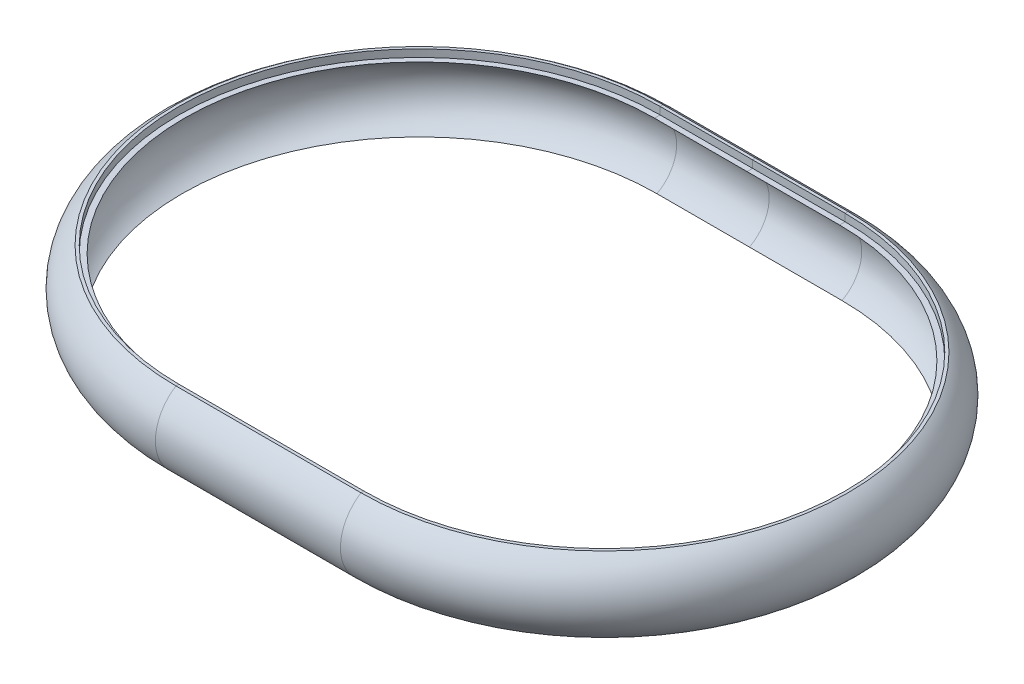
ISO-10303-21;
HEADER;
FILE_DESCRIPTION(('STEP AP214'),'2;1');
FILE_NAME('part.step','',(''),(''),'','','');
FILE_SCHEMA(('AUTOMOTIVE_DESIGN { 1 0 10303 214 1 1 1 1 }'));
ENDSEC;
DATA;
#1=APPLICATION_CONTEXT('core data for automotive mechanical design processes');
#2=APPLICATION_PROTOCOL_DEFINITION('international standard','automotive_design',2000,#1);
#3=PRODUCT_CONTEXT('',#1,'mechanical');
#4=PRODUCT('Part','Part','',(#3));
#5=PRODUCT_RELATED_PRODUCT_CATEGORY('part','',(#4));
#6=PRODUCT_DEFINITION_FORMATION('','',#4);
#7=PRODUCT_DEFINITION_CONTEXT('part definition',#1,'design');
#8=PRODUCT_DEFINITION('design','',#6,#7);
#9=PRODUCT_DEFINITION_SHAPE('','',#8);
#10=(LENGTH_UNIT() NAMED_UNIT(*) SI_UNIT(.MILLI.,.METRE.));
#11=(NAMED_UNIT(*) PLANE_ANGLE_UNIT() SI_UNIT($,.RADIAN.));
#12=(NAMED_UNIT(*) SI_UNIT($,.STERADIAN.) SOLID_ANGLE_UNIT());
#13=UNCERTAINTY_MEASURE_WITH_UNIT(LENGTH_MEASURE(1.E-05),#10,'distance_accuracy_value','');
#14=(GEOMETRIC_REPRESENTATION_CONTEXT(3) GLOBAL_UNCERTAINTY_ASSIGNED_CONTEXT((#13)) GLOBAL_UNIT_ASSIGNED_CONTEXT((#10,
#11,#12)) REPRESENTATION_CONTEXT('',''));
#15=CARTESIAN_POINT('',(0.,0.,0.));
#16=DIRECTION('',(0.,0.,1.));
#17=DIRECTION('',(1.,0.,0.));
#18=AXIS2_PLACEMENT_3D('',#15,#16,#17);
#19=CARTESIAN_POINT('',(25.,8.0398038031899,-130.));
#20=DIRECTION('',(0.,0.,-1.));
#21=DIRECTION('',(-1.,0.,0.));
#22=AXIS2_PLACEMENT_3D('',#19,#20,#21);
#23=PLANE('',#22);
#24=DIRECTION('',(0.,-1.,0.));
#25=VECTOR('',#24,1.);
#26=CARTESIAN_POINT('',(25.,8.0398038031899,-130.));
#27=LINE('',#26,#25);
#28=CARTESIAN_POINT('',(25.,8.0398038031899,-130.));
#29=VERTEX_POINT('',#28);
#30=CARTESIAN_POINT('',(25.,6.0398038031899,-130.));
#31=VERTEX_POINT('',#30);
#32=EDGE_CURVE('E222',#29,#31,#27,.T.);
#33=ORIENTED_EDGE('',*,*,#32,.F.);
#34=DIRECTION('',(-1.,0.,0.));
#35=VECTOR('',#34,1.);
#36=CARTESIAN_POINT('',(25.,8.0398038031899,-130.));
#37=LINE('',#36,#35);
#38=CARTESIAN_POINT('',(0.,8.0398038031899,-130.));
#39=VERTEX_POINT('',#38);
#40=EDGE_CURVE('E221',#29,#39,#37,.T.);
#41=ORIENTED_EDGE('',*,*,#40,.T.);
#42=DIRECTION('',(0.,-1.,0.));
#43=VECTOR('',#42,1.);
#44=CARTESIAN_POINT('',(0.,8.0398038031899,-130.));
#45=LINE('',#44,#43);
#46=CARTESIAN_POINT('',(0.,6.0398038031899,-130.));
#47=VERTEX_POINT('',#46);
#48=EDGE_CURVE('E198',#39,#47,#45,.T.);
#49=ORIENTED_EDGE('',*,*,#48,.T.);
#50=DIRECTION('',(-1.,0.,0.));
#51=VECTOR('',#50,1.);
#52=CARTESIAN_POINT('',(25.,6.0398038031899,-130.));
#53=LINE('',#52,#51);
#54=EDGE_CURVE('E227',#31,#47,#53,.T.);
#55=ORIENTED_EDGE('',*,*,#54,.F.);
#56=EDGE_LOOP('',(#33,#41,#49,#55));
#57=FACE_BOUND('',#56,.T.);
#58=ADVANCED_FACE('F39',(#57),#23,.F.);
#59=CARTESIAN_POINT('',(0.,8.0398038031899,-130.));
#60=DIRECTION('',(0.,0.,-1.));
#61=DIRECTION('',(-1.,0.,0.));
#62=AXIS2_PLACEMENT_3D('',#59,#60,#61);
#63=PLANE('',#62);
#64=DIRECTION('',(-1.,0.,0.));
#65=VECTOR('',#64,1.);
#66=CARTESIAN_POINT('',(0.,6.0398038031899,-130.));
#67=LINE('',#66,#65);
#68=CARTESIAN_POINT('',(-25.,6.0398038031899,-130.));
#69=VERTEX_POINT('',#68);
#70=EDGE_CURVE('E177',#47,#69,#67,.T.);
#71=ORIENTED_EDGE('',*,*,#70,.F.);
#72=ORIENTED_EDGE('',*,*,#48,.F.);
#73=DIRECTION('',(-1.,0.,0.));
#74=VECTOR('',#73,1.);
#75=CARTESIAN_POINT('',(0.,8.0398038031899,-130.));
#76=LINE('',#75,#74);
#77=CARTESIAN_POINT('',(-25.,8.0398038031899,-130.));
#78=VERTEX_POINT('',#77);
#79=EDGE_CURVE('E203',#39,#78,#76,.T.);
#80=ORIENTED_EDGE('',*,*,#79,.T.);
#81=DIRECTION('',(0.,-1.,0.));
#82=VECTOR('',#81,1.);
#83=CARTESIAN_POINT('',(-25.,8.0398038031899,-130.));
#84=LINE('',#83,#82);
#85=EDGE_CURVE('E218',#78,#69,#84,.T.);
#86=ORIENTED_EDGE('',*,*,#85,.T.);
#87=EDGE_LOOP('',(#71,#72,#80,#86));
#88=FACE_BOUND('',#87,.T.);
#89=ADVANCED_FACE('F202',(#88),#63,.F.);
#90=CARTESIAN_POINT('',(0.,6.0398038031899,-130.));
#91=DIRECTION('',(0.,-1.,0.));
#92=DIRECTION('',(0.,0.,-1.));
#93=AXIS2_PLACEMENT_3D('',#90,#91,#92);
#94=PLANE('',#93);
#95=DIRECTION('',(-1.,0.,0.));
#96=VECTOR('',#95,1.);
#97=CARTESIAN_POINT('',(0.,6.0398038031899,-128.5));
#98=LINE('',#97,#96);
#99=CARTESIAN_POINT('',(0.,6.0398038031899,-128.5));
#100=VERTEX_POINT('',#99);
#101=CARTESIAN_POINT('',(-25.,6.0398038031899,-128.5));
#102=VERTEX_POINT('',#101);
#103=EDGE_CURVE('E170',#100,#102,#98,.T.);
#104=ORIENTED_EDGE('',*,*,#103,.F.);
#105=DIRECTION('',(0.,0.,1.));
#106=VECTOR('',#105,1.);
#107=CARTESIAN_POINT('',(0.,6.0398038031899,-130.));
#108=LINE('',#107,#106);
#109=EDGE_CURVE('E206',#47,#100,#108,.T.);
#110=ORIENTED_EDGE('',*,*,#109,.F.);
#111=ORIENTED_EDGE('',*,*,#70,.T.);
#112=DIRECTION('',(0.,0.,1.));
#113=VECTOR('',#112,1.);
#114=CARTESIAN_POINT('',(-25.,6.0398038031899,-130.));
#115=LINE('',#114,#113);
#116=EDGE_CURVE('E336',#69,#102,#115,.T.);
#117=ORIENTED_EDGE('',*,*,#116,.T.);
#118=EDGE_LOOP('',(#104,#110,#111,#117));
#119=FACE_BOUND('',#118,.T.);
#120=ADVANCED_FACE('F452',(#119),#94,.F.);
#121=CARTESIAN_POINT('',(0.,-3.11708337553693,-124.481117419472));
#122=DIRECTION('',(-1.,0.,0.));
#123=DIRECTION('',(0.,0.,1.));
#124=AXIS2_PLACEMENT_3D('',#121,#122,#123);
#125=CYLINDRICAL_SURFACE('',#124,10.);
#126=DIRECTION('',(-1.,0.,0.));
#127=VECTOR('',#126,1.);
#128=CARTESIAN_POINT('',(0.,-11.9601961968101,-129.150095426514));
#129=LINE('',#128,#127);
#130=CARTESIAN_POINT('',(0.,-11.9601961968101,-129.150095426514));
#131=VERTEX_POINT('',#130);
#132=CARTESIAN_POINT('',(-25.,-11.9601961968101,-129.150095426514));
#133=VERTEX_POINT('',#132);
#134=EDGE_CURVE('E163',#131,#133,#129,.T.);
#135=ORIENTED_EDGE('',*,*,#134,.F.);
#136=CARTESIAN_POINT('',(0.,-3.11708337553693,-124.481117419472));
#137=DIRECTION('',(-1.,0.,0.));
#138=DIRECTION('',(0.,0.,1.));
#139=AXIS2_PLACEMENT_3D('',#136,#137,#138);
#140=CIRCLE('',#139,10.);
#141=EDGE_CURVE('E325',#100,#131,#140,.T.);
#142=ORIENTED_EDGE('',*,*,#141,.F.);
#143=ORIENTED_EDGE('',*,*,#103,.T.);
#144=CARTESIAN_POINT('',(-25.,-3.11708337553693,-124.481117419472));
#145=DIRECTION('',(-1.,0.,0.));
#146=DIRECTION('',(0.,0.,1.));
#147=AXIS2_PLACEMENT_3D('',#144,#145,#146);
#148=CIRCLE('',#147,10.);
#149=EDGE_CURVE('E331',#102,#133,#148,.T.);
#150=ORIENTED_EDGE('',*,*,#149,.T.);
#151=EDGE_LOOP('',(#135,#142,#143,#150));
#152=FACE_BOUND('',#151,.T.);
#153=ADVANCED_FACE('F434',(#152),#125,.F.);
#154=CARTESIAN_POINT('',(0.,-11.9601961968101,-129.150095426514));
#155=DIRECTION('',(0.,1.,0.));
#156=DIRECTION('',(0.,0.,1.));
#157=AXIS2_PLACEMENT_3D('',#154,#155,#156);
#158=PLANE('',#157);
#159=DIRECTION('',(-1.,0.,0.));
#160=VECTOR('',#159,1.);
#161=CARTESIAN_POINT('',(0.,-11.9601961968101,-131.150095426514));
#162=LINE('',#161,#160);
#163=CARTESIAN_POINT('',(0.,-11.9601961968101,-131.150095426514));
#164=VERTEX_POINT('',#163);
#165=CARTESIAN_POINT('',(-25.,-11.9601961968101,-131.150095426514));
#166=VERTEX_POINT('',#165);
#167=EDGE_CURVE('E282',#164,#166,#162,.T.);
#168=ORIENTED_EDGE('',*,*,#167,.F.);
#169=DIRECTION('',(0.,0.,-1.));
#170=VECTOR('',#169,1.);
#171=CARTESIAN_POINT('',(0.,-11.9601961968101,-129.150095426514));
#172=LINE('',#171,#170);
#173=EDGE_CURVE('E235',#131,#164,#172,.T.);
#174=ORIENTED_EDGE('',*,*,#173,.F.);
#175=ORIENTED_EDGE('',*,*,#134,.T.);
#176=DIRECTION('',(0.,0.,-1.));
#177=VECTOR('',#176,1.);
#178=CARTESIAN_POINT('',(-25.,-11.9601961968101,-129.150095426514));
#179=LINE('',#178,#177);
#180=EDGE_CURVE('E326',#133,#166,#179,.T.);
#181=ORIENTED_EDGE('',*,*,#180,.T.);
#182=EDGE_LOOP('',(#168,#174,#175,#181));
#183=FACE_BOUND('',#182,.T.);
#184=ADVANCED_FACE('F435',(#183),#158,.F.);
#185=CARTESIAN_POINT('',(0.,-2.07625149666633,-124.345123922936));
#186=DIRECTION('',(-1.,0.,0.));
#187=DIRECTION('',(0.,0.,1.));
#188=AXIS2_PLACEMENT_3D('',#185,#186,#187);
#189=CYLINDRICAL_SURFACE('',#188,12.);
#190=DIRECTION('',(-1.,0.,0.));
#191=VECTOR('',#190,1.);
#192=CARTESIAN_POINT('',(0.,8.0398038031899,-130.8));
#193=LINE('',#192,#191);
#194=CARTESIAN_POINT('',(0.,8.0398038031899,-130.8));
#195=VERTEX_POINT('',#194);
#196=CARTESIAN_POINT('',(-25.,8.0398038031899,-130.8));
#197=VERTEX_POINT('',#196);
#198=EDGE_CURVE('E242',#195,#197,#193,.T.);
#199=ORIENTED_EDGE('',*,*,#198,.F.);
#200=CARTESIAN_POINT('',(0.,-2.07625149666633,-124.345123922936));
#201=DIRECTION('',(1.,0.,0.));
#202=DIRECTION('',(0.,0.,1.));
#203=AXIS2_PLACEMENT_3D('',#200,#201,#202);
#204=CIRCLE('',#203,12.);
#205=EDGE_CURVE('E231',#164,#195,#204,.T.);
#206=ORIENTED_EDGE('',*,*,#205,.F.);
#207=ORIENTED_EDGE('',*,*,#167,.T.);
#208=CARTESIAN_POINT('',(-25.,-2.07625149666633,-124.345123922936));
#209=DIRECTION('',(1.,0.,0.));
#210=DIRECTION('',(0.,0.,1.));
#211=AXIS2_PLACEMENT_3D('',#208,#209,#210);
#212=CIRCLE('',#211,12.);
#213=EDGE_CURVE('E283',#166,#197,#212,.T.);
#214=ORIENTED_EDGE('',*,*,#213,.T.);
#215=EDGE_LOOP('',(#199,#206,#207,#214));
#216=FACE_BOUND('',#215,.T.);
#217=ADVANCED_FACE('F280',(#216),#189,.T.);
#218=CARTESIAN_POINT('',(0.,8.0398038031899,-130.8));
#219=DIRECTION('',(0.,-1.,0.));
#220=DIRECTION('',(0.,0.,-1.));
#221=AXIS2_PLACEMENT_3D('',#218,#219,#220);
#222=PLANE('',#221);
#223=DIRECTION('',(0.,0.,1.));
#224=VECTOR('',#223,1.);
#225=CARTESIAN_POINT('',(-25.,8.0398038031899,-130.8));
#226=LINE('',#225,#224);
#227=EDGE_CURVE('E215',#197,#78,#226,.T.);
#228=ORIENTED_EDGE('',*,*,#227,.T.);
#229=ORIENTED_EDGE('',*,*,#79,.F.);
#230=DIRECTION('',(0.,0.,1.));
#231=VECTOR('',#230,1.);
#232=CARTESIAN_POINT('',(0.,8.0398038031899,-130.8));
#233=LINE('',#232,#231);
#234=EDGE_CURVE('E213',#195,#39,#233,.T.);
#235=ORIENTED_EDGE('',*,*,#234,.F.);
#236=ORIENTED_EDGE('',*,*,#198,.T.);
#237=EDGE_LOOP('',(#228,#229,#235,#236));
#238=FACE_BOUND('',#237,.T.);
#239=ADVANCED_FACE('F211',(#238),#222,.F.);
#240=CARTESIAN_POINT('',(-25.,6.0398038031899,-65.));
#241=DIRECTION('',(0.,1.,0.));
#242=DIRECTION('',(0.,0.,1.));
#243=AXIS2_PLACEMENT_3D('',#240,#241,#242);
#244=CYLINDRICAL_SURFACE('',#243,65.);
#245=CARTESIAN_POINT('',(-25.,6.0398038031899,-65.));
#246=DIRECTION('',(0.,1.,0.));
#247=DIRECTION('',(0.,0.,-1.));
#248=AXIS2_PLACEMENT_3D('',#245,#246,#247);
#249=CIRCLE('',#248,65.);
#250=CARTESIAN_POINT('',(-25.,6.0398038031899,0.));
#251=VERTEX_POINT('',#250);
#252=EDGE_CURVE('E349',#69,#251,#249,.T.);
#253=ORIENTED_EDGE('',*,*,#252,.F.);
#254=ORIENTED_EDGE('',*,*,#85,.F.);
#255=CARTESIAN_POINT('',(-25.,8.0398038031899,-65.));
#256=DIRECTION('',(0.,1.,0.));
#257=DIRECTION('',(0.,0.,-1.));
#258=AXIS2_PLACEMENT_3D('',#255,#256,#257);
#259=CIRCLE('',#258,65.);
#260=CARTESIAN_POINT('',(-25.,8.0398038031899,0.));
#261=VERTEX_POINT('',#260);
#262=EDGE_CURVE('E241',#78,#261,#259,.T.);
#263=ORIENTED_EDGE('',*,*,#262,.T.);
#264=DIRECTION('',(0.,-1.,0.));
#265=VECTOR('',#264,1.);
#266=CARTESIAN_POINT('',(-25.,8.0398038031899,0.));
#267=LINE('',#266,#265);
#268=EDGE_CURVE('E345',#261,#251,#267,.T.);
#269=ORIENTED_EDGE('',*,*,#268,.T.);
#270=EDGE_LOOP('',(#253,#254,#263,#269));
#271=FACE_BOUND('',#270,.T.);
#272=ADVANCED_FACE('F464',(#271),#244,.F.);
#273=CARTESIAN_POINT('',(-25.,6.0398038031899,-130.));
#274=DIRECTION('',(0.,-1.,0.));
#275=DIRECTION('',(0.,0.,-1.));
#276=AXIS2_PLACEMENT_3D('',#273,#274,#275);
#277=PLANE('',#276);
#278=CARTESIAN_POINT('',(-25.,6.0398038031899,-65.));
#279=DIRECTION('',(0.,1.,0.));
#280=DIRECTION('',(0.,0.,-1.));
#281=AXIS2_PLACEMENT_3D('',#278,#279,#280);
#282=CIRCLE('',#281,63.5);
#283=CARTESIAN_POINT('',(-25.,6.0398038031899,-1.5));
#284=VERTEX_POINT('',#283);
#285=EDGE_CURVE('E147',#102,#284,#282,.T.);
#286=ORIENTED_EDGE('',*,*,#285,.F.);
#287=ORIENTED_EDGE('',*,*,#116,.F.);
#288=ORIENTED_EDGE('',*,*,#252,.T.);
#289=DIRECTION('',(0.,0.,-1.));
#290=VECTOR('',#289,1.);
#291=CARTESIAN_POINT('',(-25.,6.0398038031899,0.));
#292=LINE('',#291,#290);
#293=EDGE_CURVE('E352',#251,#284,#292,.T.);
#294=ORIENTED_EDGE('',*,*,#293,.T.);
#295=EDGE_LOOP('',(#286,#287,#288,#294));
#296=FACE_BOUND('',#295,.T.);
#297=ADVANCED_FACE('F460',(#296),#277,.F.);
#298=CARTESIAN_POINT('',(-25.,-3.11708337553693,-65.));
#299=DIRECTION('',(0.,1.,0.));
#300=DIRECTION('',(0.,0.,1.));
#301=AXIS2_PLACEMENT_3D('',#298,#299,#300);
#302=TOROIDAL_SURFACE('',#301,59.4811174194724,10.);
#303=CARTESIAN_POINT('',(-25.,-11.9601961968101,-65.));
#304=DIRECTION('',(0.,1.,0.));
#305=DIRECTION('',(0.,0.,-1.));
#306=AXIS2_PLACEMENT_3D('',#303,#304,#305);
#307=CIRCLE('',#306,64.1500954265135);
#308=CARTESIAN_POINT('',(-25.,-11.9601961968101,-0.849904573486465));
#309=VERTEX_POINT('',#308);
#310=EDGE_CURVE('E139',#133,#309,#307,.T.);
#311=ORIENTED_EDGE('',*,*,#310,.F.);
#312=ORIENTED_EDGE('',*,*,#149,.F.);
#313=ORIENTED_EDGE('',*,*,#285,.T.);
#314=CARTESIAN_POINT('',(-25.,-3.11708337553693,-5.51888258052763));
#315=DIRECTION('',(1.,0.,0.));
#316=DIRECTION('',(0.,0.,-1.));
#317=AXIS2_PLACEMENT_3D('',#314,#315,#316);
#318=CIRCLE('',#317,10.);
#319=EDGE_CURVE('E381',#284,#309,#318,.T.);
#320=ORIENTED_EDGE('',*,*,#319,.T.);
#321=EDGE_LOOP('',(#311,#312,#313,#320));
#322=FACE_BOUND('',#321,.T.);
#323=ADVANCED_FACE('F463',(#322),#302,.F.);
#324=CARTESIAN_POINT('',(-25.,-11.9601961968101,-129.150095426514));
#325=DIRECTION('',(0.,1.,0.));
#326=DIRECTION('',(0.,0.,1.));
#327=AXIS2_PLACEMENT_3D('',#324,#325,#326);
#328=PLANE('',#327);
#329=CARTESIAN_POINT('',(-25.,-11.9601961968101,-65.));
#330=DIRECTION('',(0.,1.,0.));
#331=DIRECTION('',(0.,0.,-1.));
#332=AXIS2_PLACEMENT_3D('',#329,#330,#331);
#333=CIRCLE('',#332,66.1500954265135);
#334=CARTESIAN_POINT('',(-25.,-11.9601961968101,1.15009542651354));
#335=VERTEX_POINT('',#334);
#336=EDGE_CURVE('E132',#166,#335,#333,.T.);
#337=ORIENTED_EDGE('',*,*,#336,.F.);
#338=ORIENTED_EDGE('',*,*,#180,.F.);
#339=ORIENTED_EDGE('',*,*,#310,.T.);
#340=DIRECTION('',(0.,0.,1.));
#341=VECTOR('',#340,1.);
#342=CARTESIAN_POINT('',(-25.,-11.9601961968101,-0.849904573486465));
#343=LINE('',#342,#341);
#344=EDGE_CURVE('E293',#309,#335,#343,.T.);
#345=ORIENTED_EDGE('',*,*,#344,.T.);
#346=EDGE_LOOP('',(#337,#338,#339,#345));
#347=FACE_BOUND('',#346,.T.);
#348=ADVANCED_FACE('F477',(#347),#328,.F.);
#349=CARTESIAN_POINT('',(-25.,-2.07625149666633,-65.));
#350=DIRECTION('',(0.,1.,0.));
#351=DIRECTION('',(0.,0.,1.));
#352=AXIS2_PLACEMENT_3D('',#349,#350,#351);
#353=TOROIDAL_SURFACE('',#352,59.3451239229362,12.);
#354=CARTESIAN_POINT('',(-25.,8.0398038031899,-65.));
#355=DIRECTION('',(0.,1.,0.));
#356=DIRECTION('',(0.,0.,-1.));
#357=AXIS2_PLACEMENT_3D('',#354,#355,#356);
#358=CIRCLE('',#357,65.8);
#359=CARTESIAN_POINT('',(-25.,8.0398038031899,0.799999999999995));
#360=VERTEX_POINT('',#359);
#361=EDGE_CURVE('E247',#197,#360,#358,.T.);
#362=ORIENTED_EDGE('',*,*,#361,.F.);
#363=ORIENTED_EDGE('',*,*,#213,.F.);
#364=ORIENTED_EDGE('',*,*,#336,.T.);
#365=CARTESIAN_POINT('',(-25.,-2.07625149666633,-5.65487607706382));
#366=DIRECTION('',(-1.,0.,0.));
#367=DIRECTION('',(0.,0.,-1.));
#368=AXIS2_PLACEMENT_3D('',#365,#366,#367);
#369=CIRCLE('',#368,12.);
#370=EDGE_CURVE('E289',#335,#360,#369,.T.);
#371=ORIENTED_EDGE('',*,*,#370,.T.);
#372=EDGE_LOOP('',(#362,#363,#364,#371));
#373=FACE_BOUND('',#372,.T.);
#374=ADVANCED_FACE('F487',(#373),#353,.T.);
#375=CARTESIAN_POINT('',(-25.,8.0398038031899,-130.8));
#376=DIRECTION('',(0.,-1.,0.));
#377=DIRECTION('',(0.,0.,-1.));
#378=AXIS2_PLACEMENT_3D('',#375,#376,#377);
#379=PLANE('',#378);
#380=DIRECTION('',(0.,0.,-1.));
#381=VECTOR('',#380,1.);
#382=CARTESIAN_POINT('',(-25.,8.0398038031899,0.799999999999995));
#383=LINE('',#382,#381);
#384=EDGE_CURVE('E243',#360,#261,#383,.T.);
#385=ORIENTED_EDGE('',*,*,#384,.T.);
#386=ORIENTED_EDGE('',*,*,#262,.F.);
#387=ORIENTED_EDGE('',*,*,#227,.F.);
#388=ORIENTED_EDGE('',*,*,#361,.T.);
#389=EDGE_LOOP('',(#385,#386,#387,#388));
#390=FACE_BOUND('',#389,.T.);
#391=ADVANCED_FACE('F504',(#390),#379,.F.);
#392=CARTESIAN_POINT('',(-25.,8.0398038031899,0.));
#393=DIRECTION('',(0.,0.,1.));
#394=DIRECTION('',(1.,0.,0.));
#395=AXIS2_PLACEMENT_3D('',#392,#393,#394);
#396=PLANE('',#395);
#397=DIRECTION('',(1.,0.,0.));
#398=VECTOR('',#397,1.);
#399=CARTESIAN_POINT('',(-25.,6.0398038031899,0.));
#400=LINE('',#399,#398);
#401=CARTESIAN_POINT('',(25.,6.0398038031899,0.));
#402=VERTEX_POINT('',#401);
#403=EDGE_CURVE('E359',#251,#402,#400,.T.);
#404=ORIENTED_EDGE('',*,*,#403,.F.);
#405=ORIENTED_EDGE('',*,*,#268,.F.);
#406=DIRECTION('',(1.,0.,0.));
#407=VECTOR('',#406,1.);
#408=CARTESIAN_POINT('',(-25.,8.0398038031899,0.));
#409=LINE('',#408,#407);
#410=CARTESIAN_POINT('',(25.,8.0398038031899,0.));
#411=VERTEX_POINT('',#410);
#412=EDGE_CURVE('E246',#261,#411,#409,.T.);
#413=ORIENTED_EDGE('',*,*,#412,.T.);
#414=DIRECTION('',(0.,-1.,0.));
#415=VECTOR('',#414,1.);
#416=CARTESIAN_POINT('',(25.,8.0398038031899,0.));
#417=LINE('',#416,#415);
#418=EDGE_CURVE('E267',#411,#402,#417,.T.);
#419=ORIENTED_EDGE('',*,*,#418,.T.);
#420=EDGE_LOOP('',(#404,#405,#413,#419));
#421=FACE_BOUND('',#420,.T.);
#422=ADVANCED_FACE('F468',(#421),#396,.F.);
#423=CARTESIAN_POINT('',(-25.,6.0398038031899,0.));
#424=DIRECTION('',(0.,-1.,0.));
#425=DIRECTION('',(0.,0.,-1.));
#426=AXIS2_PLACEMENT_3D('',#423,#424,#425);
#427=PLANE('',#426);
#428=DIRECTION('',(1.,0.,0.));
#429=VECTOR('',#428,1.);
#430=CARTESIAN_POINT('',(-25.,6.0398038031899,-1.5));
#431=LINE('',#430,#429);
#432=CARTESIAN_POINT('',(25.,6.0398038031899,-1.5));
#433=VERTEX_POINT('',#432);
#434=EDGE_CURVE('E362',#284,#433,#431,.T.);
#435=ORIENTED_EDGE('',*,*,#434,.F.);
#436=ORIENTED_EDGE('',*,*,#293,.F.);
#437=ORIENTED_EDGE('',*,*,#403,.T.);
#438=DIRECTION('',(0.,0.,-1.));
#439=VECTOR('',#438,1.);
#440=CARTESIAN_POINT('',(25.,6.0398038031899,0.));
#441=LINE('',#440,#439);
#442=EDGE_CURVE('E358',#402,#433,#441,.T.);
#443=ORIENTED_EDGE('',*,*,#442,.T.);
#444=EDGE_LOOP('',(#435,#436,#437,#443));
#445=FACE_BOUND('',#444,.T.);
#446=ADVANCED_FACE('F423',(#445),#427,.F.);
#447=CARTESIAN_POINT('',(-25.,-3.11708337553693,-5.51888258052763));
#448=DIRECTION('',(1.,0.,0.));
#449=DIRECTION('',(0.,0.,-1.));
#450=AXIS2_PLACEMENT_3D('',#447,#448,#449);
#451=CYLINDRICAL_SURFACE('',#450,10.);
#452=DIRECTION('',(1.,0.,0.));
#453=VECTOR('',#452,1.);
#454=CARTESIAN_POINT('',(-25.,-11.9601961968101,-0.849904573486465));
#455=LINE('',#454,#453);
#456=CARTESIAN_POINT('',(25.,-11.9601961968101,-0.849904573486465));
#457=VERTEX_POINT('',#456);
#458=EDGE_CURVE('E113',#309,#457,#455,.T.);
#459=ORIENTED_EDGE('',*,*,#458,.F.);
#460=ORIENTED_EDGE('',*,*,#319,.F.);
#461=ORIENTED_EDGE('',*,*,#434,.T.);
#462=CARTESIAN_POINT('',(25.,-3.11708337553693,-5.51888258052763));
#463=DIRECTION('',(1.,0.,0.));
#464=DIRECTION('',(0.,0.,-1.));
#465=AXIS2_PLACEMENT_3D('',#462,#463,#464);
#466=CIRCLE('',#465,10.);
#467=EDGE_CURVE('E260',#433,#457,#466,.T.);
#468=ORIENTED_EDGE('',*,*,#467,.T.);
#469=EDGE_LOOP('',(#459,#460,#461,#468));
#470=FACE_BOUND('',#469,.T.);
#471=ADVANCED_FACE('F417',(#470),#451,.F.);
#472=CARTESIAN_POINT('',(-25.,-11.9601961968101,-0.849904573486465));
#473=DIRECTION('',(0.,1.,0.));
#474=DIRECTION('',(0.,0.,1.));
#475=AXIS2_PLACEMENT_3D('',#472,#473,#474);
#476=PLANE('',#475);
#477=DIRECTION('',(1.,0.,0.));
#478=VECTOR('',#477,1.);
#479=CARTESIAN_POINT('',(-25.,-11.9601961968101,1.15009542651354));
#480=LINE('',#479,#478);
#481=CARTESIAN_POINT('',(25.,-11.9601961968101,1.15009542651354));
#482=VERTEX_POINT('',#481);
#483=EDGE_CURVE('E105',#335,#482,#480,.T.);
#484=ORIENTED_EDGE('',*,*,#483,.F.);
#485=ORIENTED_EDGE('',*,*,#344,.F.);
#486=ORIENTED_EDGE('',*,*,#458,.T.);
#487=DIRECTION('',(0.,0.,1.));
#488=VECTOR('',#487,1.);
#489=CARTESIAN_POINT('',(25.,-11.9601961968101,-0.849904573486465));
#490=LINE('',#489,#488);
#491=EDGE_CURVE('E257',#457,#482,#490,.T.);
#492=ORIENTED_EDGE('',*,*,#491,.T.);
#493=EDGE_LOOP('',(#484,#485,#486,#492));
#494=FACE_BOUND('',#493,.T.);
#495=ADVANCED_FACE('F480',(#494),#476,.F.);
#496=CARTESIAN_POINT('',(-25.,-2.07625149666633,-5.65487607706382));
#497=DIRECTION('',(1.,0.,0.));
#498=DIRECTION('',(0.,0.,-1.));
#499=AXIS2_PLACEMENT_3D('',#496,#497,#498);
#500=CYLINDRICAL_SURFACE('',#499,12.);
#501=DIRECTION('',(1.,0.,0.));
#502=VECTOR('',#501,1.);
#503=CARTESIAN_POINT('',(-25.,8.0398038031899,0.799999999999995));
#504=LINE('',#503,#502);
#505=CARTESIAN_POINT('',(25.,8.0398038031899,0.799999999999995));
#506=VERTEX_POINT('',#505);
#507=EDGE_CURVE('E95',#360,#506,#504,.T.);
#508=ORIENTED_EDGE('',*,*,#507,.F.);
#509=ORIENTED_EDGE('',*,*,#370,.F.);
#510=ORIENTED_EDGE('',*,*,#483,.T.);
#511=CARTESIAN_POINT('',(25.,-2.07625149666633,-5.65487607706382));
#512=DIRECTION('',(-1.,0.,0.));
#513=DIRECTION('',(0.,0.,-1.));
#514=AXIS2_PLACEMENT_3D('',#511,#512,#513);
#515=CIRCLE('',#514,12.);
#516=EDGE_CURVE('E251',#482,#506,#515,.T.);
#517=ORIENTED_EDGE('',*,*,#516,.T.);
#518=EDGE_LOOP('',(#508,#509,#510,#517));
#519=FACE_BOUND('',#518,.T.);
#520=ADVANCED_FACE('F489',(#519),#500,.T.);
#521=CARTESIAN_POINT('',(-25.,8.0398038031899,0.799999999999995));
#522=DIRECTION('',(0.,-1.,0.));
#523=DIRECTION('',(0.,0.,-1.));
#524=AXIS2_PLACEMENT_3D('',#521,#522,#523);
#525=PLANE('',#524);
#526=DIRECTION('',(0.,0.,-1.));
#527=VECTOR('',#526,1.);
#528=CARTESIAN_POINT('',(25.,8.0398038031899,0.799999999999995));
#529=LINE('',#528,#527);
#530=EDGE_CURVE('E248',#506,#411,#529,.T.);
#531=ORIENTED_EDGE('',*,*,#530,.T.);
#532=ORIENTED_EDGE('',*,*,#412,.F.);
#533=ORIENTED_EDGE('',*,*,#384,.F.);
#534=ORIENTED_EDGE('',*,*,#507,.T.);
#535=EDGE_LOOP('',(#531,#532,#533,#534));
#536=FACE_BOUND('',#535,.T.);
#537=ADVANCED_FACE('F508',(#536),#525,.F.);
#538=CARTESIAN_POINT('',(25.,6.0398038031899,-65.));
#539=DIRECTION('',(0.,1.,0.));
#540=DIRECTION('',(0.,0.,1.));
#541=AXIS2_PLACEMENT_3D('',#538,#539,#540);
#542=CYLINDRICAL_SURFACE('',#541,65.);
#543=CARTESIAN_POINT('',(25.,6.0398038031899,-65.));
#544=DIRECTION('',(0.,1.,0.));
#545=DIRECTION('',(0.,0.,1.));
#546=AXIS2_PLACEMENT_3D('',#543,#544,#545);
#547=CIRCLE('',#546,65.);
#548=EDGE_CURVE('E367',#402,#31,#547,.T.);
#549=ORIENTED_EDGE('',*,*,#548,.F.);
#550=ORIENTED_EDGE('',*,*,#418,.F.);
#551=CARTESIAN_POINT('',(25.,8.0398038031899,-65.));
#552=DIRECTION('',(0.,1.,0.));
#553=DIRECTION('',(0.,0.,1.));
#554=AXIS2_PLACEMENT_3D('',#551,#552,#553);
#555=CIRCLE('',#554,65.);
#556=EDGE_CURVE('E250',#411,#29,#555,.T.);
#557=ORIENTED_EDGE('',*,*,#556,.T.);
#558=ORIENTED_EDGE('',*,*,#32,.T.);
#559=EDGE_LOOP('',(#549,#550,#557,#558));
#560=FACE_BOUND('',#559,.T.);
#561=ADVANCED_FACE('F456',(#560),#542,.F.);
#562=CARTESIAN_POINT('',(25.,6.0398038031899,0.));
#563=DIRECTION('',(0.,-1.,0.));
#564=DIRECTION('',(0.,0.,-1.));
#565=AXIS2_PLACEMENT_3D('',#562,#563,#564);
#566=PLANE('',#565);
#567=CARTESIAN_POINT('',(25.,6.0398038031899,-65.));
#568=DIRECTION('',(0.,1.,0.));
#569=DIRECTION('',(0.,0.,1.));
#570=AXIS2_PLACEMENT_3D('',#567,#568,#569);
#571=CIRCLE('',#570,63.5);
#572=CARTESIAN_POINT('',(25.,6.0398038031899,-128.5));
#573=VERTEX_POINT('',#572);
#574=EDGE_CURVE('E390',#433,#573,#571,.T.);
#575=ORIENTED_EDGE('',*,*,#574,.F.);
#576=ORIENTED_EDGE('',*,*,#442,.F.);
#577=ORIENTED_EDGE('',*,*,#548,.T.);
#578=DIRECTION('',(0.,0.,1.));
#579=VECTOR('',#578,1.);
#580=CARTESIAN_POINT('',(25.,6.0398038031899,-130.));
#581=LINE('',#580,#579);
#582=EDGE_CURVE('E370',#31,#573,#581,.T.);
#583=ORIENTED_EDGE('',*,*,#582,.T.);
#584=EDGE_LOOP('',(#575,#576,#577,#583));
#585=FACE_BOUND('',#584,.T.);
#586=ADVANCED_FACE('F426',(#585),#566,.F.);
#587=CARTESIAN_POINT('',(25.,-3.11708337553693,-65.));
#588=DIRECTION('',(0.,1.,0.));
#589=DIRECTION('',(0.,0.,1.));
#590=AXIS2_PLACEMENT_3D('',#587,#588,#589);
#591=TOROIDAL_SURFACE('',#590,59.4811174194724,10.);
#592=CARTESIAN_POINT('',(25.,-11.9601961968101,-65.));
#593=DIRECTION('',(0.,1.,0.));
#594=DIRECTION('',(0.,0.,1.));
#595=AXIS2_PLACEMENT_3D('',#592,#593,#594);
#596=CIRCLE('',#595,64.1500954265135);
#597=CARTESIAN_POINT('',(25.,-11.9601961968101,-129.150095426514));
#598=VERTEX_POINT('',#597);
#599=EDGE_CURVE('E304',#457,#598,#596,.T.);
#600=ORIENTED_EDGE('',*,*,#599,.F.);
#601=ORIENTED_EDGE('',*,*,#467,.F.);
#602=ORIENTED_EDGE('',*,*,#574,.T.);
#603=CARTESIAN_POINT('',(25.,-3.11708337553693,-124.481117419472));
#604=DIRECTION('',(-1.,0.,0.));
#605=DIRECTION('',(0.,0.,1.));
#606=AXIS2_PLACEMENT_3D('',#603,#604,#605);
#607=CIRCLE('',#606,10.);
#608=EDGE_CURVE('E392',#573,#598,#607,.T.);
#609=ORIENTED_EDGE('',*,*,#608,.T.);
#610=EDGE_LOOP('',(#600,#601,#602,#609));
#611=FACE_BOUND('',#610,.T.);
#612=ADVANCED_FACE('F414',(#611),#591,.F.);
#613=CARTESIAN_POINT('',(25.,-11.9601961968101,-0.849904573486465));
#614=DIRECTION('',(0.,1.,0.));
#615=DIRECTION('',(0.,0.,1.));
#616=AXIS2_PLACEMENT_3D('',#613,#614,#615);
#617=PLANE('',#616);
#618=CARTESIAN_POINT('',(25.,-11.9601961968101,-65.));
#619=DIRECTION('',(0.,1.,0.));
#620=DIRECTION('',(0.,0.,1.));
#621=AXIS2_PLACEMENT_3D('',#618,#619,#620);
#622=CIRCLE('',#621,66.1500954265135);
#623=CARTESIAN_POINT('',(25.,-11.9601961968101,-131.150095426514));
#624=VERTEX_POINT('',#623);
#625=EDGE_CURVE('E65',#482,#624,#622,.T.);
#626=ORIENTED_EDGE('',*,*,#625,.F.);
#627=ORIENTED_EDGE('',*,*,#491,.F.);
#628=ORIENTED_EDGE('',*,*,#599,.T.);
#629=DIRECTION('',(0.,0.,-1.));
#630=VECTOR('',#629,1.);
#631=CARTESIAN_POINT('',(25.,-11.9601961968101,-129.150095426514));
#632=LINE('',#631,#630);
#633=EDGE_CURVE('E301',#598,#624,#632,.T.);
#634=ORIENTED_EDGE('',*,*,#633,.T.);
#635=EDGE_LOOP('',(#626,#627,#628,#634));
#636=FACE_BOUND('',#635,.T.);
#637=ADVANCED_FACE('F412',(#636),#617,.F.);
#638=CARTESIAN_POINT('',(25.,-2.07625149666633,-65.));
#639=DIRECTION('',(0.,1.,0.));
#640=DIRECTION('',(0.,0.,1.));
#641=AXIS2_PLACEMENT_3D('',#638,#639,#640);
#642=TOROIDAL_SURFACE('',#641,59.3451239229362,12.);
#643=CARTESIAN_POINT('',(25.,8.0398038031899,-65.));
#644=DIRECTION('',(0.,1.,0.));
#645=DIRECTION('',(0.,0.,1.));
#646=AXIS2_PLACEMENT_3D('',#643,#644,#645);
#647=CIRCLE('',#646,65.8);
#648=CARTESIAN_POINT('',(25.,8.0398038031899,-130.8));
#649=VERTEX_POINT('',#648);
#650=EDGE_CURVE('E57',#506,#649,#647,.T.);
#651=ORIENTED_EDGE('',*,*,#650,.F.);
#652=ORIENTED_EDGE('',*,*,#516,.F.);
#653=ORIENTED_EDGE('',*,*,#625,.T.);
#654=CARTESIAN_POINT('',(25.,-2.07625149666633,-124.345123922936));
#655=DIRECTION('',(1.,0.,0.));
#656=DIRECTION('',(0.,0.,1.));
#657=AXIS2_PLACEMENT_3D('',#654,#655,#656);
#658=CIRCLE('',#657,12.);
#659=EDGE_CURVE('E268',#624,#649,#658,.T.);
#660=ORIENTED_EDGE('',*,*,#659,.T.);
#661=EDGE_LOOP('',(#651,#652,#653,#660));
#662=FACE_BOUND('',#661,.T.);
#663=ADVANCED_FACE('F491',(#662),#642,.T.);
#664=CARTESIAN_POINT('',(25.,8.0398038031899,0.799999999999995));
#665=DIRECTION('',(0.,-1.,0.));
#666=DIRECTION('',(0.,0.,-1.));
#667=AXIS2_PLACEMENT_3D('',#664,#665,#666);
#668=PLANE('',#667);
#669=DIRECTION('',(0.,0.,1.));
#670=VECTOR('',#669,1.);
#671=CARTESIAN_POINT('',(25.,8.0398038031899,-130.8));
#672=LINE('',#671,#670);
#673=EDGE_CURVE('E43',#649,#29,#672,.T.);
#674=ORIENTED_EDGE('',*,*,#673,.T.);
#675=ORIENTED_EDGE('',*,*,#556,.F.);
#676=ORIENTED_EDGE('',*,*,#530,.F.);
#677=ORIENTED_EDGE('',*,*,#650,.T.);
#678=EDGE_LOOP('',(#674,#675,#676,#677));
#679=FACE_BOUND('',#678,.T.);
#680=ADVANCED_FACE('F272',(#679),#668,.F.);
#681=CARTESIAN_POINT('',(25.,6.0398038031899,-130.));
#682=DIRECTION('',(0.,-1.,0.));
#683=DIRECTION('',(0.,0.,-1.));
#684=AXIS2_PLACEMENT_3D('',#681,#682,#683);
#685=PLANE('',#684);
#686=ORIENTED_EDGE('',*,*,#54,.T.);
#687=ORIENTED_EDGE('',*,*,#109,.T.);
#688=DIRECTION('',(-1.,0.,0.));
#689=VECTOR('',#688,1.);
#690=CARTESIAN_POINT('',(25.,6.0398038031899,-128.5));
#691=LINE('',#690,#689);
#692=EDGE_CURVE('E311',#573,#100,#691,.T.);
#693=ORIENTED_EDGE('',*,*,#692,.F.);
#694=ORIENTED_EDGE('',*,*,#582,.F.);
#695=EDGE_LOOP('',(#686,#687,#693,#694));
#696=FACE_BOUND('',#695,.T.);
#697=ADVANCED_FACE('F433',(#696),#685,.F.);
#698=CARTESIAN_POINT('',(25.,-3.11708337553693,-124.481117419472));
#699=DIRECTION('',(-1.,0.,0.));
#700=DIRECTION('',(0.,0.,1.));
#701=AXIS2_PLACEMENT_3D('',#698,#699,#700);
#702=CYLINDRICAL_SURFACE('',#701,10.);
#703=ORIENTED_EDGE('',*,*,#692,.T.);
#704=ORIENTED_EDGE('',*,*,#141,.T.);
#705=DIRECTION('',(-1.,0.,0.));
#706=VECTOR('',#705,1.);
#707=CARTESIAN_POINT('',(25.,-11.9601961968101,-129.150095426514));
#708=LINE('',#707,#706);
#709=EDGE_CURVE('E308',#598,#131,#708,.T.);
#710=ORIENTED_EDGE('',*,*,#709,.F.);
#711=ORIENTED_EDGE('',*,*,#608,.F.);
#712=EDGE_LOOP('',(#703,#704,#710,#711));
#713=FACE_BOUND('',#712,.T.);
#714=ADVANCED_FACE('F432',(#713),#702,.F.);
#715=CARTESIAN_POINT('',(25.,-11.9601961968101,-129.150095426514));
#716=DIRECTION('',(0.,1.,0.));
#717=DIRECTION('',(0.,0.,1.));
#718=AXIS2_PLACEMENT_3D('',#715,#716,#717);
#719=PLANE('',#718);
#720=ORIENTED_EDGE('',*,*,#709,.T.);
#721=ORIENTED_EDGE('',*,*,#173,.T.);
#722=DIRECTION('',(-1.,0.,0.));
#723=VECTOR('',#722,1.);
#724=CARTESIAN_POINT('',(25.,-11.9601961968101,-131.150095426514));
#725=LINE('',#724,#723);
#726=EDGE_CURVE('E49',#624,#164,#725,.T.);
#727=ORIENTED_EDGE('',*,*,#726,.F.);
#728=ORIENTED_EDGE('',*,*,#633,.F.);
#729=EDGE_LOOP('',(#720,#721,#727,#728));
#730=FACE_BOUND('',#729,.T.);
#731=ADVANCED_FACE('F436',(#730),#719,.F.);
#732=CARTESIAN_POINT('',(25.,-2.07625149666633,-124.345123922936));
#733=DIRECTION('',(-1.,0.,0.));
#734=DIRECTION('',(0.,0.,1.));
#735=AXIS2_PLACEMENT_3D('',#732,#733,#734);
#736=CYLINDRICAL_SURFACE('',#735,12.);
#737=ORIENTED_EDGE('',*,*,#726,.T.);
#738=ORIENTED_EDGE('',*,*,#205,.T.);
#739=DIRECTION('',(-1.,0.,0.));
#740=VECTOR('',#739,1.);
#741=CARTESIAN_POINT('',(25.,8.0398038031899,-130.8));
#742=LINE('',#741,#740);
#743=EDGE_CURVE('E11',#649,#195,#742,.T.);
#744=ORIENTED_EDGE('',*,*,#743,.F.);
#745=ORIENTED_EDGE('',*,*,#659,.F.);
#746=EDGE_LOOP('',(#737,#738,#744,#745));
#747=FACE_BOUND('',#746,.T.);
#748=ADVANCED_FACE('F276',(#747),#736,.T.);
#749=CARTESIAN_POINT('',(25.,8.0398038031899,-130.8));
#750=DIRECTION('',(0.,-1.,0.));
#751=DIRECTION('',(0.,0.,-1.));
#752=AXIS2_PLACEMENT_3D('',#749,#750,#751);
#753=PLANE('',#752);
#754=ORIENTED_EDGE('',*,*,#743,.T.);
#755=ORIENTED_EDGE('',*,*,#234,.T.);
#756=ORIENTED_EDGE('',*,*,#40,.F.);
#757=ORIENTED_EDGE('',*,*,#673,.F.);
#758=EDGE_LOOP('',(#754,#755,#756,#757));
#759=FACE_BOUND('',#758,.T.);
#760=ADVANCED_FACE('F41',(#759),#753,.F.);
#761=CLOSED_SHELL('',(#58,#89,#120,#153,#184,#217,#239,#272,#297,#323,#348,#374,#391,#422,#446,
#471,#495,#520,#537,#561,#586,#612,#637,#663,#680,#697,#714,#731,#748,#760));
#762=MANIFOLD_SOLID_BREP('B2',#761);
#763=ADVANCED_BREP_SHAPE_REPRESENTATION('',(#18,#762),#14);
#764=SHAPE_DEFINITION_REPRESENTATION(#9,#763);
ENDSEC;
END-ISO-10303-21;
